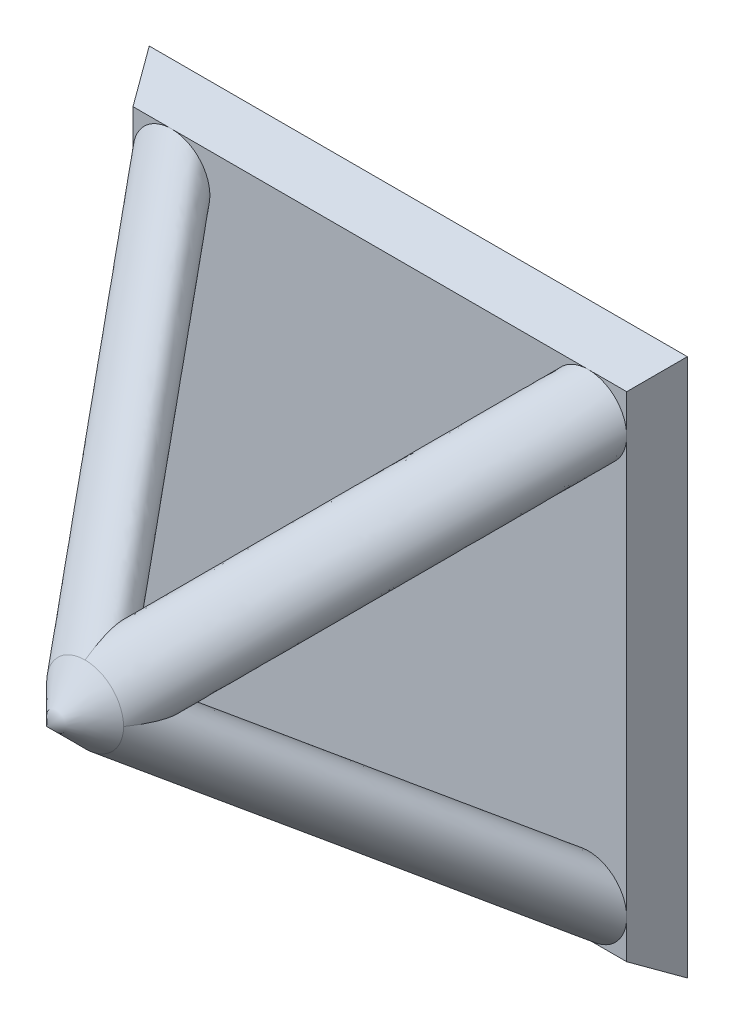
ISO-10303-21;
HEADER;
FILE_DESCRIPTION(('STEP AP214'),'2;1');
FILE_NAME('part.step','',(''),(''),'','','');
FILE_SCHEMA(('AUTOMOTIVE_DESIGN { 1 0 10303 214 1 1 1 1 }'));
ENDSEC;
DATA;
#1=APPLICATION_CONTEXT('core data for automotive mechanical design processes');
#2=APPLICATION_PROTOCOL_DEFINITION('international standard','automotive_design',2000,#1);
#3=PRODUCT_CONTEXT('',#1,'mechanical');
#4=PRODUCT('Part','Part','',(#3));
#5=PRODUCT_RELATED_PRODUCT_CATEGORY('part','',(#4));
#6=PRODUCT_DEFINITION_FORMATION('','',#4);
#7=PRODUCT_DEFINITION_CONTEXT('part definition',#1,'design');
#8=PRODUCT_DEFINITION('design','',#6,#7);
#9=PRODUCT_DEFINITION_SHAPE('','',#8);
#10=(LENGTH_UNIT() NAMED_UNIT(*) SI_UNIT(.MILLI.,.METRE.));
#11=(NAMED_UNIT(*) PLANE_ANGLE_UNIT() SI_UNIT($,.RADIAN.));
#12=(NAMED_UNIT(*) SI_UNIT($,.STERADIAN.) SOLID_ANGLE_UNIT());
#13=UNCERTAINTY_MEASURE_WITH_UNIT(LENGTH_MEASURE(1.E-05),#10,'distance_accuracy_value','');
#14=(GEOMETRIC_REPRESENTATION_CONTEXT(3) GLOBAL_UNCERTAINTY_ASSIGNED_CONTEXT((#13)) GLOBAL_UNIT_ASSIGNED_CONTEXT((#10,
#11,#12)) REPRESENTATION_CONTEXT('',''));
#15=CARTESIAN_POINT('',(0.,0.,0.));
#16=DIRECTION('',(0.,0.,1.));
#17=DIRECTION('',(1.,0.,0.));
#18=AXIS2_PLACEMENT_3D('',#15,#16,#17);
#19=CARTESIAN_POINT('',(0.,0.,1.));
#20=DIRECTION('',(0.,0.,1.));
#21=DIRECTION('',(1.,0.,0.));
#22=AXIS2_PLACEMENT_3D('',#19,#20,#21);
#23=PLANE('',#22);
#24=DIRECTION('',(-1.,0.,0.));
#25=VECTOR('',#24,1.);
#26=CARTESIAN_POINT('',(-7.,-6.42264973081037,1.));
#27=LINE('',#26,#25);
#28=CARTESIAN_POINT('',(-5.42264973081037,-6.42264973081037,1.));
#29=VERTEX_POINT('',#28);
#30=CARTESIAN_POINT('',(5.42264973081043,-6.42264973081037,1.));
#31=VERTEX_POINT('',#30);
#32=EDGE_CURVE('E254',#29,#31,#27,.F.);
#33=ORIENTED_EDGE('',*,*,#32,.T.);
#34=CARTESIAN_POINT('',(5.42264973081043,-5.42264973081032,1.));
#35=DIRECTION('',(0.,0.,1.));
#36=DIRECTION('',(0.,-1.,0.));
#37=AXIS2_PLACEMENT_3D('',#34,#35,#36);
#38=CIRCLE('',#37,1.);
#39=CARTESIAN_POINT('',(6.42264973081037,-5.42264973081032,1.));
#40=VERTEX_POINT('',#39);
#41=EDGE_CURVE('E52',#40,#31,#38,.T.);
#42=ORIENTED_EDGE('',*,*,#41,.F.);
#43=DIRECTION('',(0.,-1.,0.));
#44=VECTOR('',#43,1.);
#45=CARTESIAN_POINT('',(6.42264973081037,7.,1.));
#46=LINE('',#45,#44);
#47=CARTESIAN_POINT('',(6.42264973081037,5.42264973081037,1.));
#48=VERTEX_POINT('',#47);
#49=EDGE_CURVE('E259',#40,#48,#46,.F.);
#50=ORIENTED_EDGE('',*,*,#49,.T.);
#51=CARTESIAN_POINT('',(5.42264973081037,5.42264973081037,1.));
#52=DIRECTION('',(0.,0.,1.));
#53=DIRECTION('',(1.,0.,0.));
#54=AXIS2_PLACEMENT_3D('',#51,#52,#53);
#55=CIRCLE('',#54,1.);
#56=CARTESIAN_POINT('',(5.42264973081037,6.42264973081037,1.));
#57=VERTEX_POINT('',#56);
#58=EDGE_CURVE('E150',#57,#48,#55,.T.);
#59=ORIENTED_EDGE('',*,*,#58,.F.);
#60=DIRECTION('',(1.,0.,0.));
#61=VECTOR('',#60,1.);
#62=CARTESIAN_POINT('',(-7.,6.42264973081037,1.));
#63=LINE('',#62,#61);
#64=CARTESIAN_POINT('',(-5.42264973081039,6.42264973081037,1.));
#65=VERTEX_POINT('',#64);
#66=EDGE_CURVE('E260',#57,#65,#63,.F.);
#67=ORIENTED_EDGE('',*,*,#66,.T.);
#68=CARTESIAN_POINT('',(-5.42264973081039,5.42264973081035,1.));
#69=DIRECTION('',(0.,0.,1.));
#70=DIRECTION('',(0.,1.,0.));
#71=AXIS2_PLACEMENT_3D('',#68,#69,#70);
#72=CIRCLE('',#71,1.);
#73=CARTESIAN_POINT('',(-6.42264973081039,5.42264973081035,1.));
#74=VERTEX_POINT('',#73);
#75=EDGE_CURVE('E172',#74,#65,#72,.T.);
#76=ORIENTED_EDGE('',*,*,#75,.F.);
#77=DIRECTION('',(0.,1.,0.));
#78=VECTOR('',#77,1.);
#79=CARTESIAN_POINT('',(-6.42264973081037,7.,1.));
#80=LINE('',#79,#78);
#81=CARTESIAN_POINT('',(-6.42264973081037,-5.42264973081037,1.));
#82=VERTEX_POINT('',#81);
#83=EDGE_CURVE('E250',#74,#82,#80,.F.);
#84=ORIENTED_EDGE('',*,*,#83,.T.);
#85=CARTESIAN_POINT('',(-5.42264973081037,-5.42264973081037,1.));
#86=DIRECTION('',(0.,0.,1.));
#87=DIRECTION('',(-1.,0.,0.));
#88=AXIS2_PLACEMENT_3D('',#85,#86,#87);
#89=CIRCLE('',#88,1.);
#90=EDGE_CURVE('E59',#29,#82,#89,.T.);
#91=ORIENTED_EDGE('',*,*,#90,.F.);
#92=EDGE_LOOP('',(#33,#42,#50,#59,#67,#76,#84,#91));
#93=FACE_BOUND('',#92,.T.);
#94=ADVANCED_FACE('F33',(#93),#23,.T.);
#95=CARTESIAN_POINT('',(6.42264973081037,-6.42264973081037,1.));
#96=VERTEX_POINT('',#95);
#97=EDGE_CURVE('E255',#96,#40,#46,.F.);
#98=ORIENTED_EDGE('',*,*,#97,.T.);
#99=EDGE_CURVE('E179',#31,#40,#38,.T.);
#100=ORIENTED_EDGE('',*,*,#99,.F.);
#101=EDGE_CURVE('E249',#31,#96,#27,.F.);
#102=ORIENTED_EDGE('',*,*,#101,.T.);
#103=EDGE_LOOP('',(#98,#100,#102));
#104=FACE_BOUND('',#103,.T.);
#105=ADVANCED_FACE('F194',(#104),#23,.T.);
#106=CARTESIAN_POINT('',(0.,0.,8.66878479331103));
#107=DIRECTION('',(0.,0.,1.));
#108=DIRECTION('',(1.,0.,0.));
#109=AXIS2_PLACEMENT_3D('',#106,#107,#108);
#110=CIRCLE('',#109,1.);
#111=DIRECTION('',(0.499999999999994,0.499999999999994,-0.707106781186556));
#112=VECTOR('',#111,1.);
#113=SURFACE_OF_LINEAR_EXTRUSION('',#110,#112);
#114=EDGE_CURVE('E134',#48,#57,#55,.T.);
#115=ORIENTED_EDGE('',*,*,#114,.T.);
#116=ORIENTED_EDGE('',*,*,#58,.T.);
#117=EDGE_LOOP('',(#115,#116));
#118=FACE_BOUND('',#117,.T.);
#119=CARTESIAN_POINT('',(1.,0.,8.66878479331103));
#120=CARTESIAN_POINT('',(1.00125351260411,0.,8.66701203694065));
#121=CARTESIAN_POINT('',(1.00250547707911,0.,8.66523815971749));
#122=CARTESIAN_POINT('',(1.05177963010609,-1.13950144105511E-12,8.59529158950284));
#123=CARTESIAN_POINT('',(1.09750457961302,-2.96295620383264E-13,8.52546410229372));
#124=CARTESIAN_POINT('',(1.18320273610694,3.03552048356278E-13,8.38227426077338));
#125=CARTESIAN_POINT('',(1.22317400657764,0.,8.30891072737279));
#126=CARTESIAN_POINT('',(1.27720903599113,0.,8.19594785885561));
#127=CARTESIAN_POINT('',(1.29424623147074,0.,8.15777208511721));
#128=CARTESIAN_POINT('',(1.32585803322013,0.,8.08044776784854));
#129=CARTESIAN_POINT('',(1.34043481738279,0.,8.04130012018707));
#130=CARTESIAN_POINT('',(1.37011081883751,0.,7.95107125668239));
#131=CARTESIAN_POINT('',(1.38425645444796,0.,7.89966230539449));
#132=CARTESIAN_POINT('',(1.40289470391753,0.,7.80769678596866));
#133=CARTESIAN_POINT('',(1.40888158909515,0.,7.76746062739503));
#134=CARTESIAN_POINT('',(1.41347575601538,0.,7.70679345094834));
#135=CARTESIAN_POINT('',(1.41427756531805,0.,7.68654027121802));
#136=CARTESIAN_POINT('',(1.41414075186115,0.,7.64604338296767));
#137=CARTESIAN_POINT('',(1.41320034318602,0.,7.62579970546722));
#138=CARTESIAN_POINT('',(1.40673928934434,0.,7.5607735053365));
#139=CARTESIAN_POINT('',(1.39703703427399,0.,7.51611303847837));
#140=CARTESIAN_POINT('',(1.37284280559329,0.,7.45679875903693));
#141=CARTESIAN_POINT('',(1.36433046786529,0.,7.43968077898095));
#142=CARTESIAN_POINT('',(1.3445495057793,0.,7.40710875524325));
#143=CARTESIAN_POINT('',(1.3332835411708,0.,7.39165312650585));
#144=CARTESIAN_POINT('',(1.30810876720699,0.,7.36296144627793));
#145=CARTESIAN_POINT('',(1.29419045622811,0.,7.34973370700803));
#146=CARTESIAN_POINT('',(1.26422163758882,0.,7.32596771895557));
#147=CARTESIAN_POINT('',(1.24816980858937,-1.32363845123164E-13,7.31543114879018));
#148=CARTESIAN_POINT('',(1.21156805666884,-1.53190008169267E-13,7.29548928594295));
#149=CARTESIAN_POINT('',(1.19072713553021,0.,7.28662348042738));
#150=CARTESIAN_POINT('',(1.1478629468222,0.,7.27236954013865));
#151=CARTESIAN_POINT('',(1.12583630725207,0.,7.26699196002415));
#152=CARTESIAN_POINT('',(1.08613989486768,0.,7.26003511184371));
#153=CARTESIAN_POINT('',(1.0685634701425,0.,7.25788439245572));
#154=CARTESIAN_POINT('',(1.03332076039402,0.,7.2551306737989));
#155=CARTESIAN_POINT('',(1.01565463532375,0.,7.25452551527694));
#156=CARTESIAN_POINT('',(0.962589402129848,0.,7.25467141146948));
#157=CARTESIAN_POINT('',(0.927195588123745,0.,7.25739432714266));
#158=CARTESIAN_POINT('',(0.857926646435491,0.,7.26655859722238));
#159=CARTESIAN_POINT('',(0.824036315735433,0.,7.2728975744653));
#160=CARTESIAN_POINT('',(0.756888677887,0.,7.28837490086369));
#161=CARTESIAN_POINT('',(0.723631858005194,0.,7.29751531918902));
#162=CARTESIAN_POINT('',(0.637909545565728,0.,7.32419678696361));
#163=CARTESIAN_POINT('',(0.585989254110225,0.,7.34347540277906));
#164=CARTESIAN_POINT('',(0.483869083503985,0.,7.38618480602128));
#165=CARTESIAN_POINT('',(0.433671087968722,0.,7.40961997677362));
#166=CARTESIAN_POINT('',(0.335103166347748,0.,7.45963814573174));
#167=CARTESIAN_POINT('',(0.286727411181714,0.,7.48620973669409));
#168=CARTESIAN_POINT('',(0.19151609569873,0.,7.54198754554198));
#169=CARTESIAN_POINT('',(0.144680967438423,0.,7.57119449404065));
#170=CARTESIAN_POINT('',(0.00647350137431064,0.,7.6620802624616));
#171=CARTESIAN_POINT('',(-0.0827217598947179,0.,7.72708778221502));
#172=CARTESIAN_POINT('',(-0.255525771216759,0.,7.86401185115602));
#173=CARTESIAN_POINT('',(-0.339135967993752,0.,7.93592659927478));
#174=CARTESIAN_POINT('',(-0.500778926578633,0.,8.08576940604033));
#175=CARTESIAN_POINT('',(-0.5788121380018,1.1063852847646E-13,8.1636969788788));
#176=CARTESIAN_POINT('',(-0.715298274246241,0.,8.31053248943573));
#177=CARTESIAN_POINT('',(-0.774740964637548,-3.15910362594946E-13,8.37852482779859));
#178=CARTESIAN_POINT('',(-0.889098579797068,3.1379105980321E-13,8.51820761407654));
#179=CARTESIAN_POINT('',(-0.944015514668744,1.1676884444505E-12,8.58989639697296));
#180=CARTESIAN_POINT('',(-0.997491356953355,0.,8.66524039059186));
#181=CARTESIAN_POINT('',(-0.99874646278963,0.,8.66701204606627));
#182=CARTESIAN_POINT('',(-1.00000000000001,0.,8.66878479331105));
#183=B_SPLINE_CURVE_WITH_KNOTS('',3,(#119,#120,#121,#122,#123,#124,#125,#126,#127,#128,#129,
#130,#131,#132,#133,#134,#135,#136,#137,#138,#139,#140,#141,#142,#143,#144,#145,#146,#147,#148,
#149,#150,#151,#152,#153,#154,#155,#156,#157,#158,#159,#160,#161,#162,#163,#164,#165,#166,#167,
#168,#169,#170,#171,#172,#173,#174,#175,#176,#177,#178,#179,#180,#181,#182),.UNSPECIFIED.,.F.,
.F.,(4,2,2,2,2,2,2,2,2,2,2,2,2,2,2,2,2,2,2,2,2,2,2,2,2,2,2,2,2,2,2,4),(0.,0.00651355818792192,
0.256676675039786,0.506923793427388,0.632270310530457,0.75750528553668,0.917094236577142,
1.03880359275309,1.09953123586477,1.16032116421139,1.29510015727741,1.35223140377982,
1.40930768334578,1.46659241016314,1.52391278155495,1.59148632278405,1.65926338561674,
1.71231232437563,1.7652871095344,1.87145297525223,1.97475251880974,2.07812854497407,
2.24401569601678,2.410078836132,2.57555560349622,2.74107838858642,3.07171589838484,
3.40226742687418,3.73279227624387,4.00357543624725,4.27423767300741,4.28075123118571),.UNSPECIFIED.);
#184=CARTESIAN_POINT('',(0.,-1.08197955803191E-12,7.66878479331024));
#185=VERTEX_POINT('',#184);
#186=CARTESIAN_POINT('',(1.,0.,8.66878479331103));
#187=VERTEX_POINT('',#186);
#188=EDGE_CURVE('E146',#185,#187,#183,.F.);
#189=ORIENTED_EDGE('',*,*,#188,.F.);
#190=CARTESIAN_POINT('',(0.,1.,8.66878479331103));
#191=CARTESIAN_POINT('',(0.,1.00125351260411,8.66701203694065));
#192=CARTESIAN_POINT('',(0.,1.00250547707911,8.66523815971749));
#193=CARTESIAN_POINT('',(1.1468639539726E-12,1.05177963010607,8.59529158950283));
#194=CARTESIAN_POINT('',(3.01009439263273E-13,1.09750457961302,8.52546410229372));
#195=CARTESIAN_POINT('',(-3.00514103024104E-13,1.18320273610695,8.38227426077338));
#196=CARTESIAN_POINT('',(0.,1.22317400657764,8.30891072737279));
#197=CARTESIAN_POINT('',(0.,1.27720903599113,8.19594785885561));
#198=CARTESIAN_POINT('',(0.,1.29424623147074,8.15777208511721));
#199=CARTESIAN_POINT('',(0.,1.32585803322013,8.08044776784854));
#200=CARTESIAN_POINT('',(0.,1.34043481738279,8.04130012018707));
#201=CARTESIAN_POINT('',(0.,1.3701108188375,7.95107125668239));
#202=CARTESIAN_POINT('',(0.,1.38425645444795,7.89966230539449));
#203=CARTESIAN_POINT('',(0.,1.40289470391753,7.80769678596866));
#204=CARTESIAN_POINT('',(0.,1.40888158909514,7.76746062739504));
#205=CARTESIAN_POINT('',(0.,1.41347575601537,7.70679345094835));
#206=CARTESIAN_POINT('',(0.,1.41427756531804,7.68654027121802));
#207=CARTESIAN_POINT('',(0.,1.41414075186114,7.64604338296768));
#208=CARTESIAN_POINT('',(0.,1.41320034318601,7.62579970546723));
#209=CARTESIAN_POINT('',(0.,1.40673928934433,7.56077350533651));
#210=CARTESIAN_POINT('',(0.,1.39703703427397,7.51611303847838));
#211=CARTESIAN_POINT('',(0.,1.37284280559328,7.45679875903694));
#212=CARTESIAN_POINT('',(0.,1.36433046786528,7.43968077898096));
#213=CARTESIAN_POINT('',(0.,1.34454950577929,7.40710875524326));
#214=CARTESIAN_POINT('',(0.,1.33328354117079,7.39165312650586));
#215=CARTESIAN_POINT('',(0.,1.30810876720697,7.36296144627794));
#216=CARTESIAN_POINT('',(0.,1.2941904562281,7.34973370700804));
#217=CARTESIAN_POINT('',(0.,1.2642216375888,7.32596771895558));
#218=CARTESIAN_POINT('',(1.36830909798032E-13,1.24816980858936,7.31543114879019));
#219=CARTESIAN_POINT('',(1.5737326136133E-13,1.21156805666883,7.29548928594295));
#220=CARTESIAN_POINT('',(0.,1.1907271355302,7.28662348042739));
#221=CARTESIAN_POINT('',(0.,1.14786294682218,7.27236954013866));
#222=CARTESIAN_POINT('',(0.,1.12583630725205,7.26699196002416));
#223=CARTESIAN_POINT('',(0.,1.08613989486766,7.26003511184371));
#224=CARTESIAN_POINT('',(0.,1.06856347014248,7.25788439245573));
#225=CARTESIAN_POINT('',(0.,1.033320760394,7.25513067379891));
#226=CARTESIAN_POINT('',(0.,1.01565463532374,7.25452551527695));
#227=CARTESIAN_POINT('',(0.,0.962589402129827,7.25467141146949));
#228=CARTESIAN_POINT('',(0.,0.927195588123723,7.25739432714267));
#229=CARTESIAN_POINT('',(0.,0.857926646435468,7.26655859722239));
#230=CARTESIAN_POINT('',(0.,0.824036315735409,7.27289757446531));
#231=CARTESIAN_POINT('',(0.,0.756888677886974,7.2883749008637));
#232=CARTESIAN_POINT('',(0.,0.723631858005168,7.29751531918903));
#233=CARTESIAN_POINT('',(0.,0.637909545565701,7.32419678696362));
#234=CARTESIAN_POINT('',(0.,0.585989254110196,7.34347540277908));
#235=CARTESIAN_POINT('',(0.,0.483869083503955,7.38618480602129));
#236=CARTESIAN_POINT('',(0.,0.433671087968691,7.40961997677364));
#237=CARTESIAN_POINT('',(0.,0.335103166347716,7.45963814573176));
#238=CARTESIAN_POINT('',(0.,0.28672741118168,7.48620973669411));
#239=CARTESIAN_POINT('',(0.,0.191516095698695,7.541987545542));
#240=CARTESIAN_POINT('',(0.,0.144680967438387,7.57119449404067));
#241=CARTESIAN_POINT('',(0.,0.0064735013742735,7.66208026246163));
#242=CARTESIAN_POINT('',(0.,-0.0827217598947566,7.72708778221505));
#243=CARTESIAN_POINT('',(0.,-0.2555257712168,7.86401185115605));
#244=CARTESIAN_POINT('',(0.,-0.339135967993793,7.93592659927481));
#245=CARTESIAN_POINT('',(0.,-0.500778926578677,8.08576940604037));
#246=CARTESIAN_POINT('',(0.,-0.578812138001846,8.16369697887884));
#247=CARTESIAN_POINT('',(0.,-0.715298274246335,8.31053248943584));
#248=CARTESIAN_POINT('',(2.06137644354064E-13,-0.774740964637686,8.37852482779875));
#249=CARTESIAN_POINT('',(-2.10006954731077E-13,-0.889098579797306,8.51820761407683));
#250=CARTESIAN_POINT('',(-7.72252081318399E-13,-0.944015514669037,8.5898963969733));
#251=CARTESIAN_POINT('',(0.,-0.997491356953659,8.66524039059229));
#252=CARTESIAN_POINT('',(0.,-0.998746462789935,8.6670120460667));
#253=CARTESIAN_POINT('',(0.,-1.00000000000032,8.66878479331148));
#254=B_SPLINE_CURVE_WITH_KNOTS('',3,(#190,#191,#192,#193,#194,#195,#196,#197,#198,#199,#200,
#201,#202,#203,#204,#205,#206,#207,#208,#209,#210,#211,#212,#213,#214,#215,#216,#217,#218,#219,
#220,#221,#222,#223,#224,#225,#226,#227,#228,#229,#230,#231,#232,#233,#234,#235,#236,#237,#238,
#239,#240,#241,#242,#243,#244,#245,#246,#247,#248,#249,#250,#251,#252,#253),.UNSPECIFIED.,.F.,
.F.,(4,2,2,2,2,2,2,2,2,2,2,2,2,2,2,2,2,2,2,2,2,2,2,2,2,2,2,2,2,2,2,4),(0.,0.00651355818792067,
0.256676675039784,0.506923793427385,0.632270310530456,0.757505285536678,0.917094236577136,
1.03880359275308,1.09953123586476,1.16032116421138,1.2951001572774,1.35223140377981,
1.40930768334577,1.46659241016313,1.52391278155494,1.59148632278405,1.65926338561674,
1.71231232437563,1.7652871095344,1.87145297525223,1.97475251880975,2.07812854497408,
2.24401569601679,2.41007883613201,2.57555560349624,2.74107838858644,3.07171589838486,
3.40226742687421,3.7327922762439,4.00357543624751,4.27423767300791,4.28075123118621),.UNSPECIFIED.);
#255=CARTESIAN_POINT('',(0.,1.,8.66878479331103));
#256=VERTEX_POINT('',#255);
#257=EDGE_CURVE('E141',#256,#185,#254,.T.);
#258=ORIENTED_EDGE('',*,*,#257,.F.);
#259=EDGE_CURVE('E124',#187,#256,#110,.T.);
#260=ORIENTED_EDGE('',*,*,#259,.F.);
#261=EDGE_LOOP('',(#189,#258,#260));
#262=FACE_BOUND('',#261,.T.);
#263=ADVANCED_FACE('F145',(#118,#262),#113,.F.);
#264=CARTESIAN_POINT('',(0.,0.,8.66878479331103));
#265=DIRECTION('',(0.,0.,1.));
#266=DIRECTION('',(-1.,0.,0.));
#267=AXIS2_PLACEMENT_3D('',#264,#265,#266);
#268=CIRCLE('',#267,1.);
#269=DIRECTION('',(-0.499999999999994,-0.499999999999994,-0.707106781186556));
#270=VECTOR('',#269,1.);
#271=SURFACE_OF_LINEAR_EXTRUSION('',#268,#270);
#272=EDGE_CURVE('E171',#82,#29,#89,.T.);
#273=ORIENTED_EDGE('',*,*,#272,.T.);
#274=ORIENTED_EDGE('',*,*,#90,.T.);
#275=EDGE_LOOP('',(#273,#274));
#276=FACE_BOUND('',#275,.T.);
#277=CARTESIAN_POINT('',(0.,-1.,8.66878479331103));
#278=CARTESIAN_POINT('',(0.,-1.00125351260411,8.66701203694065));
#279=CARTESIAN_POINT('',(0.,-1.00250547707911,8.66523815971749));
#280=CARTESIAN_POINT('',(-7.61693546182484E-13,-1.05177963010607,8.59529158950283));
#281=CARTESIAN_POINT('',(-1.99534752926289E-13,-1.09750457961302,8.52546410229372));
#282=CARTESIAN_POINT('',(2.02312714620442E-13,-1.18320273610695,8.38227426077338));
#283=CARTESIAN_POINT('',(0.,-1.22317400657764,8.30891072737279));
#284=CARTESIAN_POINT('',(0.,-1.27720903599113,8.19594785885561));
#285=CARTESIAN_POINT('',(0.,-1.29424623147073,8.1577720851172));
#286=CARTESIAN_POINT('',(0.,-1.32585803322012,8.08044776784854));
#287=CARTESIAN_POINT('',(0.,-1.34043481738279,8.04130012018706));
#288=CARTESIAN_POINT('',(0.,-1.3701108188375,7.95107125668239));
#289=CARTESIAN_POINT('',(0.,-1.38425645444795,7.89966230539449));
#290=CARTESIAN_POINT('',(0.,-1.40289470391752,7.80769678596866));
#291=CARTESIAN_POINT('',(0.,-1.40888158909513,7.76746062739504));
#292=CARTESIAN_POINT('',(0.,-1.41347575601536,7.70679345094835));
#293=CARTESIAN_POINT('',(0.,-1.41427756531804,7.68654027121802));
#294=CARTESIAN_POINT('',(0.,-1.41414075186113,7.64604338296768));
#295=CARTESIAN_POINT('',(0.,-1.41320034318601,7.62579970546723));
#296=CARTESIAN_POINT('',(0.,-1.40673928934433,7.56077350533651));
#297=CARTESIAN_POINT('',(0.,-1.39703703427397,7.51611303847838));
#298=CARTESIAN_POINT('',(0.,-1.37284280559327,7.45679875903694));
#299=CARTESIAN_POINT('',(0.,-1.36433046786527,7.43968077898096));
#300=CARTESIAN_POINT('',(0.,-1.34454950577928,7.40710875524326));
#301=CARTESIAN_POINT('',(0.,-1.33328354117078,7.39165312650586));
#302=CARTESIAN_POINT('',(0.,-1.30810876720696,7.36296144627794));
#303=CARTESIAN_POINT('',(0.,-1.29419045622809,7.34973370700804));
#304=CARTESIAN_POINT('',(0.,-1.26422163758879,7.32596771895558));
#305=CARTESIAN_POINT('',(-1.32406005235521E-13,-1.24816980858935,7.31543114879019));
#306=CARTESIAN_POINT('',(-1.53140306675341E-13,-1.21156805666882,7.29548928594296));
#307=CARTESIAN_POINT('',(0.,-1.19072713553019,7.2866234804274));
#308=CARTESIAN_POINT('',(0.,-1.14786294682217,7.27236954013866));
#309=CARTESIAN_POINT('',(0.,-1.12583630725204,7.26699196002417));
#310=CARTESIAN_POINT('',(0.,-1.08613989486765,7.26003511184372));
#311=CARTESIAN_POINT('',(0.,-1.06856347014247,7.25788439245573));
#312=CARTESIAN_POINT('',(0.,-1.03332076039399,7.25513067379892));
#313=CARTESIAN_POINT('',(0.,-1.01565463532372,7.25452551527695));
#314=CARTESIAN_POINT('',(0.,-0.962589402129811,7.25467141146949));
#315=CARTESIAN_POINT('',(0.,-0.927195588123706,7.25739432714268));
#316=CARTESIAN_POINT('',(0.,-0.857926646435448,7.26655859722239));
#317=CARTESIAN_POINT('',(0.,-0.824036315735388,7.27289757446531));
#318=CARTESIAN_POINT('',(0.,-0.756888677886951,7.28837490086371));
#319=CARTESIAN_POINT('',(0.,-0.723631858005144,7.29751531918904));
#320=CARTESIAN_POINT('',(0.,-0.637909545565674,7.32419678696363));
#321=CARTESIAN_POINT('',(0.,-0.585989254110167,7.34347540277909));
#322=CARTESIAN_POINT('',(0.,-0.483869083503923,7.38618480602131));
#323=CARTESIAN_POINT('',(0.,-0.433671087968658,7.40961997677366));
#324=CARTESIAN_POINT('',(0.,-0.33510316634768,7.45963814573178));
#325=CARTESIAN_POINT('',(0.,-0.286727411181643,7.48620973669413));
#326=CARTESIAN_POINT('',(0.,-0.191516095698655,7.54198754554202));
#327=CARTESIAN_POINT('',(0.,-0.144680967438346,7.5711944940407));
#328=CARTESIAN_POINT('',(0.,-0.00647350137422814,7.66208026246166));
#329=CARTESIAN_POINT('',(0.,0.0827217598948041,7.72708778221508));
#330=CARTESIAN_POINT('',(0.,0.255525771216851,7.8640118511561));
#331=CARTESIAN_POINT('',(0.,0.339135967993847,7.93592659927486));
#332=CARTESIAN_POINT('',(0.,0.500778926578734,8.08576940604043));
#333=CARTESIAN_POINT('',(2.40733299714894E-13,0.578812138001903,8.1636969788789));
#334=CARTESIAN_POINT('',(-1.99193686013419E-13,0.715298274246384,8.31053248943589));
#335=CARTESIAN_POINT('',(-6.83442162856511E-13,0.774740964637727,8.3785248277988));
#336=CARTESIAN_POINT('',(6.78322884987512E-13,0.889098579797323,8.51820761407685));
#337=CARTESIAN_POINT('',(2.52329588452121E-12,0.94401551466904,8.58989639697332));
#338=CARTESIAN_POINT('',(1.51589111309589E-13,0.997491356953659,8.66524039059229));
#339=CARTESIAN_POINT('',(0.,0.998746462789934,8.6670120460667));
#340=CARTESIAN_POINT('',(0.,1.00000000000032,8.66878479331148));
#341=B_SPLINE_CURVE_WITH_KNOTS('',3,(#277,#278,#279,#280,#281,#282,#283,#284,#285,#286,#287,
#288,#289,#290,#291,#292,#293,#294,#295,#296,#297,#298,#299,#300,#301,#302,#303,#304,#305,#306,
#307,#308,#309,#310,#311,#312,#313,#314,#315,#316,#317,#318,#319,#320,#321,#322,#323,#324,#325,
#326,#327,#328,#329,#330,#331,#332,#333,#334,#335,#336,#337,#338,#339,#340),.UNSPECIFIED.,.F.,
.F.,(4,2,2,2,2,2,2,2,2,2,2,2,2,2,2,2,2,2,2,2,2,2,2,2,2,2,2,2,2,2,2,4),(0.,0.00651355818792067,
0.256676675039785,0.506923793427386,0.632270310530459,0.757505285536681,0.917094236577137,
1.03880359275308,1.09953123586476,1.16032116421138,1.2951001572774,1.35223140377981,
1.40930768334577,1.46659241016313,1.52391278155494,1.59148632278404,1.65926338561674,
1.71231232437563,1.7652871095344,1.87145297525223,1.97475251880976,2.07812854497409,
2.24401569601681,2.41007883613204,2.57555560349627,2.74107838858647,3.07171589838492,
3.40226742687427,3.73279227624398,4.00357543624755,4.2742376730079,4.2807512311862),.UNSPECIFIED.);
#342=CARTESIAN_POINT('',(0.,-1.,8.66878479331103));
#343=VERTEX_POINT('',#342);
#344=EDGE_CURVE('E11',#343,#185,#341,.T.);
#345=ORIENTED_EDGE('',*,*,#344,.F.);
#346=CARTESIAN_POINT('',(-1.,0.,8.66878479331103));
#347=VERTEX_POINT('',#346);
#348=EDGE_CURVE('E136',#347,#343,#110,.T.);
#349=ORIENTED_EDGE('',*,*,#348,.F.);
#350=CARTESIAN_POINT('',(-1.,0.,8.66878479331103));
#351=CARTESIAN_POINT('',(-1.00125351260411,0.,8.66701203694065));
#352=CARTESIAN_POINT('',(-1.00250547707911,0.,8.66523815971749));
#353=CARTESIAN_POINT('',(-1.05177963010607,1.14541266112503E-12,8.59529158950283));
#354=CARTESIAN_POINT('',(-1.09750457961302,3.00100561111796E-13,8.52546410229372));
#355=CARTESIAN_POINT('',(-1.18320273610695,-3.00526646255673E-13,8.38227426077339));
#356=CARTESIAN_POINT('',(-1.22317400657764,0.,8.3089107273728));
#357=CARTESIAN_POINT('',(-1.27720903599113,0.,8.19594785885561));
#358=CARTESIAN_POINT('',(-1.29424623147074,0.,8.15777208511721));
#359=CARTESIAN_POINT('',(-1.32585803322013,0.,8.08044776784855));
#360=CARTESIAN_POINT('',(-1.34043481738279,0.,8.04130012018707));
#361=CARTESIAN_POINT('',(-1.37011081883751,0.,7.9510712566824));
#362=CARTESIAN_POINT('',(-1.38425645444795,0.,7.89966230539449));
#363=CARTESIAN_POINT('',(-1.40289470391753,0.,7.80769678596866));
#364=CARTESIAN_POINT('',(-1.40888158909514,0.,7.76746062739504));
#365=CARTESIAN_POINT('',(-1.41347575601537,0.,7.70679345094835));
#366=CARTESIAN_POINT('',(-1.41427756531805,0.,7.68654027121802));
#367=CARTESIAN_POINT('',(-1.41414075186114,0.,7.64604338296768));
#368=CARTESIAN_POINT('',(-1.41320034318602,0.,7.62579970546723));
#369=CARTESIAN_POINT('',(-1.40673928934434,0.,7.56077350533651));
#370=CARTESIAN_POINT('',(-1.39703703427398,0.,7.51611303847838));
#371=CARTESIAN_POINT('',(-1.37284280559328,0.,7.45679875903694));
#372=CARTESIAN_POINT('',(-1.36433046786529,0.,7.43968077898095));
#373=CARTESIAN_POINT('',(-1.3445495057793,0.,7.40710875524325));
#374=CARTESIAN_POINT('',(-1.3332835411708,0.,7.39165312650586));
#375=CARTESIAN_POINT('',(-1.30810876720698,0.,7.36296144627794));
#376=CARTESIAN_POINT('',(-1.29419045622811,0.,7.34973370700804));
#377=CARTESIAN_POINT('',(-1.26422163758881,0.,7.32596771895558));
#378=CARTESIAN_POINT('',(-1.24816980858936,1.36812441665084E-13,7.31543114879018));
#379=CARTESIAN_POINT('',(-1.21156805666883,1.57395032977822E-13,7.29548928594295));
#380=CARTESIAN_POINT('',(-1.19072713553021,0.,7.28662348042739));
#381=CARTESIAN_POINT('',(-1.14786294682219,0.,7.27236954013865));
#382=CARTESIAN_POINT('',(-1.12583630725206,0.,7.26699196002416));
#383=CARTESIAN_POINT('',(-1.08613989486767,0.,7.26003511184371));
#384=CARTESIAN_POINT('',(-1.06856347014249,0.,7.25788439245572));
#385=CARTESIAN_POINT('',(-1.03332076039401,0.,7.25513067379891));
#386=CARTESIAN_POINT('',(-1.01565463532375,0.,7.25452551527694));
#387=CARTESIAN_POINT('',(-0.962589402129838,0.,7.25467141146948));
#388=CARTESIAN_POINT('',(-0.927195588123734,0.,7.25739432714267));
#389=CARTESIAN_POINT('',(-0.85792664643548,0.,7.26655859722238));
#390=CARTESIAN_POINT('',(-0.824036315735421,0.,7.2728975744653));
#391=CARTESIAN_POINT('',(-0.756888677886987,0.,7.2883749008637));
#392=CARTESIAN_POINT('',(-0.723631858005181,0.,7.29751531918903));
#393=CARTESIAN_POINT('',(-0.637909545565714,0.,7.32419678696362));
#394=CARTESIAN_POINT('',(-0.58598925411021,0.,7.34347540277907));
#395=CARTESIAN_POINT('',(-0.48386908350397,0.,7.38618480602129));
#396=CARTESIAN_POINT('',(-0.433671087968706,0.,7.40961997677363));
#397=CARTESIAN_POINT('',(-0.335103166347731,0.,7.45963814573175));
#398=CARTESIAN_POINT('',(-0.286727411181696,0.,7.4862097366941));
#399=CARTESIAN_POINT('',(-0.191516095698712,0.,7.54198754554199));
#400=CARTESIAN_POINT('',(-0.144680967438405,0.,7.57119449404066));
#401=CARTESIAN_POINT('',(-0.00647350137429159,0.,7.66208026246161));
#402=CARTESIAN_POINT('',(0.0827217598947381,0.,7.72708778221504));
#403=CARTESIAN_POINT('',(0.25552577121678,0.,7.86401185115604));
#404=CARTESIAN_POINT('',(0.339135967993773,0.,7.9359265992748));
#405=CARTESIAN_POINT('',(0.500778926578656,0.,8.08576940604035));
#406=CARTESIAN_POINT('',(0.578812138001825,-1.64855284072305E-13,8.16369697887882));
#407=CARTESIAN_POINT('',(0.715298274246319,1.39298768821473E-13,8.31053248943582));
#408=CARTESIAN_POINT('',(0.774740964637675,4.73083483210469E-13,8.37852482779874));
#409=CARTESIAN_POINT('',(0.889098579797298,-4.74091674103254E-13,8.51820761407682));
#410=CARTESIAN_POINT('',(0.944015514669028,-1.75433051822151E-12,8.5898963969733));
#411=CARTESIAN_POINT('',(0.997491356953659,-1.1843371045989E-13,8.66524039059229));
#412=CARTESIAN_POINT('',(0.998746462789934,0.,8.6670120460667));
#413=CARTESIAN_POINT('',(1.00000000000032,0.,8.66878479331148));
#414=B_SPLINE_CURVE_WITH_KNOTS('',3,(#350,#351,#352,#353,#354,#355,#356,#357,#358,#359,#360,
#361,#362,#363,#364,#365,#366,#367,#368,#369,#370,#371,#372,#373,#374,#375,#376,#377,#378,#379,
#380,#381,#382,#383,#384,#385,#386,#387,#388,#389,#390,#391,#392,#393,#394,#395,#396,#397,#398,
#399,#400,#401,#402,#403,#404,#405,#406,#407,#408,#409,#410,#411,#412,#413),.UNSPECIFIED.,.F.,
.F.,(4,2,2,2,2,2,2,2,2,2,2,2,2,2,2,2,2,2,2,2,2,2,2,2,2,2,2,2,2,2,2,4),(0.,0.00651355818792067,
0.256676675039783,0.506923793427384,0.632270310530453,0.757505285536676,0.917094236577137,
1.03880359275308,1.09953123586477,1.16032116421138,1.29510015727741,1.35223140377982,
1.40930768334577,1.46659241016314,1.52391278155495,1.59148632278405,1.65926338561674,
1.71231232437563,1.7652871095344,1.87145297525223,1.97475251880975,2.07812854497408,
2.24401569601679,2.41007883613201,2.57555560349623,2.74107838858643,3.07171589838485,
3.4022674268742,3.73279227624388,4.00357543624751,4.27423767300793,4.28075123118622),.UNSPECIFIED.);
#415=EDGE_CURVE('E46',#347,#185,#414,.T.);
#416=ORIENTED_EDGE('',*,*,#415,.T.);
#417=EDGE_LOOP('',(#345,#349,#416));
#418=FACE_BOUND('',#417,.T.);
#419=ADVANCED_FACE('F165',(#276,#418),#271,.F.);
#420=CARTESIAN_POINT('',(-6.42264973081037,-6.42264973081037,1.));
#421=VERTEX_POINT('',#420);
#422=EDGE_CURVE('E251',#421,#29,#27,.F.);
#423=ORIENTED_EDGE('',*,*,#422,.T.);
#424=ORIENTED_EDGE('',*,*,#272,.F.);
#425=EDGE_CURVE('E236',#82,#421,#80,.F.);
#426=ORIENTED_EDGE('',*,*,#425,.T.);
#427=EDGE_LOOP('',(#423,#424,#426));
#428=FACE_BOUND('',#427,.T.);
#429=ADVANCED_FACE('F163',(#428),#23,.T.);
#430=CARTESIAN_POINT('',(0.,0.,8.66878479331103));
#431=DIRECTION('',(0.,0.,1.));
#432=DIRECTION('',(0.,1.,0.));
#433=AXIS2_PLACEMENT_3D('',#430,#431,#432);
#434=CIRCLE('',#433,1.);
#435=DIRECTION('',(-0.499999999999996,0.499999999999992,-0.707106781186556));
#436=VECTOR('',#435,1.);
#437=SURFACE_OF_LINEAR_EXTRUSION('',#434,#436);
#438=EDGE_CURVE('E143',#65,#74,#72,.T.);
#439=ORIENTED_EDGE('',*,*,#438,.T.);
#440=ORIENTED_EDGE('',*,*,#75,.T.);
#441=EDGE_LOOP('',(#439,#440));
#442=FACE_BOUND('',#441,.T.);
#443=ORIENTED_EDGE('',*,*,#415,.F.);
#444=EDGE_CURVE('E126',#256,#347,#434,.T.);
#445=ORIENTED_EDGE('',*,*,#444,.F.);
#446=ORIENTED_EDGE('',*,*,#257,.T.);
#447=EDGE_LOOP('',(#443,#445,#446));
#448=FACE_BOUND('',#447,.T.);
#449=ADVANCED_FACE('F140',(#442,#448),#437,.F.);
#450=CARTESIAN_POINT('',(-6.42264973081037,6.42264973081037,1.));
#451=VERTEX_POINT('',#450);
#452=EDGE_CURVE('E246',#451,#74,#80,.F.);
#453=ORIENTED_EDGE('',*,*,#452,.T.);
#454=ORIENTED_EDGE('',*,*,#438,.F.);
#455=EDGE_CURVE('E258',#65,#451,#63,.F.);
#456=ORIENTED_EDGE('',*,*,#455,.T.);
#457=EDGE_LOOP('',(#453,#454,#456));
#458=FACE_BOUND('',#457,.T.);
#459=ADVANCED_FACE('F162',(#458),#23,.T.);
#460=ORIENTED_EDGE('',*,*,#114,.F.);
#461=CARTESIAN_POINT('',(6.42264973081037,6.42264973081037,1.));
#462=VERTEX_POINT('',#461);
#463=EDGE_CURVE('E216',#48,#462,#46,.F.);
#464=ORIENTED_EDGE('',*,*,#463,.T.);
#465=EDGE_CURVE('E219',#462,#57,#63,.F.);
#466=ORIENTED_EDGE('',*,*,#465,.T.);
#467=EDGE_LOOP('',(#460,#464,#466));
#468=FACE_BOUND('',#467,.T.);
#469=ADVANCED_FACE('F196',(#468),#23,.T.);
#470=CARTESIAN_POINT('',(-7.,7.,0.));
#471=DIRECTION('',(-0.866025403784438,0.,0.500000000000001));
#472=DIRECTION('',(0.500000000000001,0.,0.866025403784438));
#473=AXIS2_PLACEMENT_3D('',#470,#471,#472);
#474=PLANE('',#473);
#475=DIRECTION('',(0.,-1.,0.));
#476=VECTOR('',#475,1.);
#477=CARTESIAN_POINT('',(-7.,7.,0.));
#478=LINE('',#477,#476);
#479=CARTESIAN_POINT('',(-7.,7.,0.));
#480=VERTEX_POINT('',#479);
#481=CARTESIAN_POINT('',(-7.,-7.,0.));
#482=VERTEX_POINT('',#481);
#483=EDGE_CURVE('E228',#480,#482,#478,.T.);
#484=ORIENTED_EDGE('',*,*,#483,.T.);
#485=DIRECTION('',(-0.447213595499959,-0.447213595499959,-0.774596669241483));
#486=VECTOR('',#485,1.);
#487=CARTESIAN_POINT('',(-7.,-7.,0.));
#488=LINE('',#487,#486);
#489=EDGE_CURVE('E223',#421,#482,#488,.T.);
#490=ORIENTED_EDGE('',*,*,#489,.F.);
#491=ORIENTED_EDGE('',*,*,#425,.F.);
#492=ORIENTED_EDGE('',*,*,#83,.F.);
#493=ORIENTED_EDGE('',*,*,#452,.F.);
#494=DIRECTION('',(-0.447213595499959,0.447213595499959,-0.774596669241483));
#495=VECTOR('',#494,1.);
#496=CARTESIAN_POINT('',(-7.,7.,0.));
#497=LINE('',#496,#495);
#498=EDGE_CURVE('E238',#451,#480,#497,.T.);
#499=ORIENTED_EDGE('',*,*,#498,.T.);
#500=EDGE_LOOP('',(#484,#490,#491,#492,#493,#499));
#501=FACE_BOUND('',#500,.T.);
#502=ADVANCED_FACE('F203',(#501),#474,.T.);
#503=CARTESIAN_POINT('',(-7.,-7.,0.));
#504=DIRECTION('',(0.,-0.866025403784438,0.500000000000001));
#505=DIRECTION('',(0.,-0.500000000000001,-0.866025403784438));
#506=AXIS2_PLACEMENT_3D('',#503,#504,#505);
#507=PLANE('',#506);
#508=DIRECTION('',(1.,0.,0.));
#509=VECTOR('',#508,1.);
#510=CARTESIAN_POINT('',(-7.,-7.,0.));
#511=LINE('',#510,#509);
#512=CARTESIAN_POINT('',(7.,-7.,0.));
#513=VERTEX_POINT('',#512);
#514=EDGE_CURVE('E231',#482,#513,#511,.T.);
#515=ORIENTED_EDGE('',*,*,#514,.T.);
#516=DIRECTION('',(0.447213595499959,-0.447213595499959,-0.774596669241483));
#517=VECTOR('',#516,1.);
#518=CARTESIAN_POINT('',(4.19999999999999,-4.19999999999999,4.84974226119286));
#519=LINE('',#518,#517);
#520=EDGE_CURVE('E225',#96,#513,#519,.T.);
#521=ORIENTED_EDGE('',*,*,#520,.F.);
#522=ORIENTED_EDGE('',*,*,#101,.F.);
#523=ORIENTED_EDGE('',*,*,#32,.F.);
#524=ORIENTED_EDGE('',*,*,#422,.F.);
#525=ORIENTED_EDGE('',*,*,#489,.T.);
#526=EDGE_LOOP('',(#515,#521,#522,#523,#524,#525));
#527=FACE_BOUND('',#526,.T.);
#528=ADVANCED_FACE('F35',(#527),#507,.T.);
#529=CARTESIAN_POINT('',(7.,7.,0.));
#530=DIRECTION('',(0.866025403784438,0.,0.500000000000001));
#531=DIRECTION('',(0.500000000000001,0.,-0.866025403784438));
#532=AXIS2_PLACEMENT_3D('',#529,#530,#531);
#533=PLANE('',#532);
#534=DIRECTION('',(0.,1.,0.));
#535=VECTOR('',#534,1.);
#536=CARTESIAN_POINT('',(7.,7.,0.));
#537=LINE('',#536,#535);
#538=CARTESIAN_POINT('',(7.,7.,0.));
#539=VERTEX_POINT('',#538);
#540=EDGE_CURVE('E233',#513,#539,#537,.T.);
#541=ORIENTED_EDGE('',*,*,#540,.T.);
#542=DIRECTION('',(0.447213595499959,0.447213595499959,-0.774596669241483));
#543=VECTOR('',#542,1.);
#544=CARTESIAN_POINT('',(4.19999999999999,4.19999999999999,4.84974226119286));
#545=LINE('',#544,#543);
#546=EDGE_CURVE('E241',#462,#539,#545,.T.);
#547=ORIENTED_EDGE('',*,*,#546,.F.);
#548=ORIENTED_EDGE('',*,*,#463,.F.);
#549=ORIENTED_EDGE('',*,*,#49,.F.);
#550=ORIENTED_EDGE('',*,*,#97,.F.);
#551=ORIENTED_EDGE('',*,*,#520,.T.);
#552=EDGE_LOOP('',(#541,#547,#548,#549,#550,#551));
#553=FACE_BOUND('',#552,.T.);
#554=ADVANCED_FACE('F285',(#553),#533,.T.);
#555=CARTESIAN_POINT('',(-7.,7.,0.));
#556=DIRECTION('',(0.,0.866025403784438,0.500000000000001));
#557=DIRECTION('',(0.,-0.500000000000001,0.866025403784438));
#558=AXIS2_PLACEMENT_3D('',#555,#556,#557);
#559=PLANE('',#558);
#560=DIRECTION('',(-1.,0.,0.));
#561=VECTOR('',#560,1.);
#562=CARTESIAN_POINT('',(-7.,7.,0.));
#563=LINE('',#562,#561);
#564=EDGE_CURVE('E235',#539,#480,#563,.T.);
#565=ORIENTED_EDGE('',*,*,#564,.T.);
#566=ORIENTED_EDGE('',*,*,#498,.F.);
#567=ORIENTED_EDGE('',*,*,#455,.F.);
#568=ORIENTED_EDGE('',*,*,#66,.F.);
#569=ORIENTED_EDGE('',*,*,#465,.F.);
#570=ORIENTED_EDGE('',*,*,#546,.T.);
#571=EDGE_LOOP('',(#565,#566,#567,#568,#569,#570));
#572=FACE_BOUND('',#571,.T.);
#573=ADVANCED_FACE('F189',(#572),#559,.T.);
#574=CARTESIAN_POINT('',(0.,0.,0.));
#575=DIRECTION('',(0.,0.,1.));
#576=DIRECTION('',(1.,0.,0.));
#577=AXIS2_PLACEMENT_3D('',#574,#575,#576);
#578=PLANE('',#577);
#579=ORIENTED_EDGE('',*,*,#483,.F.);
#580=ORIENTED_EDGE('',*,*,#564,.F.);
#581=ORIENTED_EDGE('',*,*,#540,.F.);
#582=ORIENTED_EDGE('',*,*,#514,.F.);
#583=EDGE_LOOP('',(#579,#580,#581,#582));
#584=FACE_BOUND('',#583,.T.);
#585=ADVANCED_FACE('F183',(#584),#578,.F.);
#586=CARTESIAN_POINT('',(0.,0.,8.66878479331103));
#587=DIRECTION('',(0.,0.,1.));
#588=DIRECTION('',(0.,-1.,0.));
#589=AXIS2_PLACEMENT_3D('',#586,#587,#588);
#590=CIRCLE('',#589,1.);
#591=DIRECTION('',(0.499999999999999,-0.499999999999989,-0.707106781186556));
#592=VECTOR('',#591,1.);
#593=SURFACE_OF_LINEAR_EXTRUSION('',#590,#592);
#594=ORIENTED_EDGE('',*,*,#99,.T.);
#595=ORIENTED_EDGE('',*,*,#41,.T.);
#596=EDGE_LOOP('',(#594,#595));
#597=FACE_BOUND('',#596,.T.);
#598=ORIENTED_EDGE('',*,*,#344,.T.);
#599=ORIENTED_EDGE('',*,*,#188,.T.);
#600=EDGE_CURVE('E129',#343,#187,#110,.T.);
#601=ORIENTED_EDGE('',*,*,#600,.F.);
#602=EDGE_LOOP('',(#598,#599,#601));
#603=FACE_BOUND('',#602,.T.);
#604=ADVANCED_FACE('F121',(#597,#603),#593,.F.);
#605=CARTESIAN_POINT('',(0.,0.,8.66878479331103));
#606=DIRECTION('',(0.,0.,-1.));
#607=DIRECTION('',(1.,0.,0.));
#608=AXIS2_PLACEMENT_3D('',#605,#606,#607);
#609=CONICAL_SURFACE('',#608,1.,0.78539816339745);
#610=CARTESIAN_POINT('',(0.,0.,9.66878479331103));
#611=VERTEX_POINT('',#610);
#612=VERTEX_LOOP('',#611);
#613=FACE_BOUND('',#612,.T.);
#614=ORIENTED_EDGE('',*,*,#259,.T.);
#615=ORIENTED_EDGE('',*,*,#444,.T.);
#616=ORIENTED_EDGE('',*,*,#348,.T.);
#617=ORIENTED_EDGE('',*,*,#600,.T.);
#618=EDGE_LOOP('',(#614,#615,#616,#617));
#619=FACE_BOUND('',#618,.T.);
#620=ADVANCED_FACE('F118',(#613,#619),#609,.T.);
#621=CLOSED_SHELL('',(#94,#105,#263,#419,#429,#449,#459,#469,#502,#528,#554,#573,#585,#604,#620));
#622=MANIFOLD_SOLID_BREP('B2',#621);
#623=ADVANCED_BREP_SHAPE_REPRESENTATION('',(#18,#622),#14);
#624=SHAPE_DEFINITION_REPRESENTATION(#9,#623);
ENDSEC;
END-ISO-10303-21;
